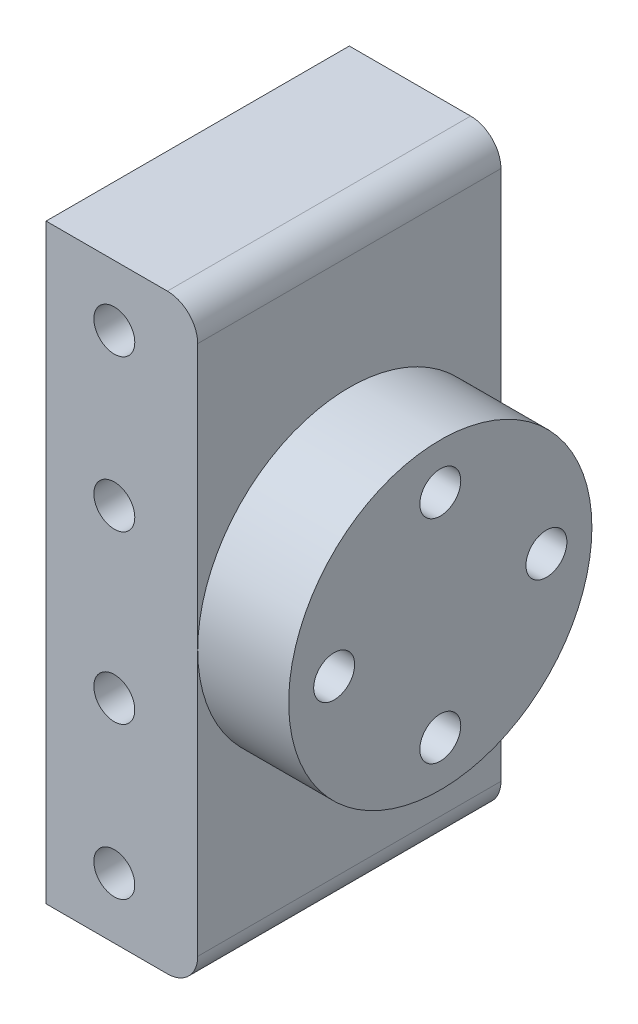
ISO-10303-21;
HEADER;
FILE_DESCRIPTION(('STEP AP214'),'2;1');
FILE_NAME('part.step','',(''),(''),'','','');
FILE_SCHEMA(('AUTOMOTIVE_DESIGN { 1 0 10303 214 1 1 1 1 }'));
ENDSEC;
DATA;
#1=APPLICATION_CONTEXT('core data for automotive mechanical design processes');
#2=APPLICATION_PROTOCOL_DEFINITION('international standard','automotive_design',2000,#1);
#3=PRODUCT_CONTEXT('',#1,'mechanical');
#4=PRODUCT('Part','Part','',(#3));
#5=PRODUCT_RELATED_PRODUCT_CATEGORY('part','',(#4));
#6=PRODUCT_DEFINITION_FORMATION('','',#4);
#7=PRODUCT_DEFINITION_CONTEXT('part definition',#1,'design');
#8=PRODUCT_DEFINITION('design','',#6,#7);
#9=PRODUCT_DEFINITION_SHAPE('','',#8);
#10=(LENGTH_UNIT() NAMED_UNIT(*) SI_UNIT(.MILLI.,.METRE.));
#11=(NAMED_UNIT(*) PLANE_ANGLE_UNIT() SI_UNIT($,.RADIAN.));
#12=(NAMED_UNIT(*) SI_UNIT($,.STERADIAN.) SOLID_ANGLE_UNIT());
#13=UNCERTAINTY_MEASURE_WITH_UNIT(LENGTH_MEASURE(1.E-05),#10,'distance_accuracy_value','');
#14=(GEOMETRIC_REPRESENTATION_CONTEXT(3) GLOBAL_UNCERTAINTY_ASSIGNED_CONTEXT((#13)) GLOBAL_UNIT_ASSIGNED_CONTEXT((#10,
#11,#12)) REPRESENTATION_CONTEXT('',''));
#15=CARTESIAN_POINT('',(0.,0.,0.));
#16=DIRECTION('',(0.,0.,1.));
#17=DIRECTION('',(1.,0.,0.));
#18=AXIS2_PLACEMENT_3D('',#15,#16,#17);
#19=CARTESIAN_POINT('',(5.,-17.5,20.));
#20=DIRECTION('',(-1.,0.,0.));
#21=DIRECTION('',(0.,0.,1.));
#22=AXIS2_PLACEMENT_3D('',#19,#20,#21);
#23=PLANE('',#22);
#24=CARTESIAN_POINT('',(5.,0.,10.));
#25=DIRECTION('',(1.,0.,0.));
#26=DIRECTION('',(0.,0.,-1.));
#27=AXIS2_PLACEMENT_3D('',#24,#25,#26);
#28=CIRCLE('',#27,10.);
#29=CARTESIAN_POINT('',(5.,0.,20.));
#30=VERTEX_POINT('',#29);
#31=CARTESIAN_POINT('',(5.,0.,0.));
#32=VERTEX_POINT('',#31);
#33=EDGE_CURVE('E155',#30,#32,#28,.T.);
#34=ORIENTED_EDGE('',*,*,#33,.F.);
#35=DIRECTION('',(0.,1.,0.));
#36=VECTOR('',#35,1.);
#37=CARTESIAN_POINT('',(5.,-17.5,20.));
#38=LINE('',#37,#36);
#39=CARTESIAN_POINT('',(5.,-17.5,20.));
#40=VERTEX_POINT('',#39);
#41=EDGE_CURVE('E106',#40,#30,#38,.T.);
#42=ORIENTED_EDGE('',*,*,#41,.F.);
#43=DIRECTION('',(0.,0.,-1.));
#44=VECTOR('',#43,1.);
#45=CARTESIAN_POINT('',(5.,-17.5,20.));
#46=LINE('',#45,#44);
#47=CARTESIAN_POINT('',(5.,-17.5,0.));
#48=VERTEX_POINT('',#47);
#49=EDGE_CURVE('E116',#40,#48,#46,.T.);
#50=ORIENTED_EDGE('',*,*,#49,.T.);
#51=DIRECTION('',(0.,1.,0.));
#52=VECTOR('',#51,1.);
#53=CARTESIAN_POINT('',(5.,-17.5,0.));
#54=LINE('',#53,#52);
#55=EDGE_CURVE('E133',#48,#32,#54,.T.);
#56=ORIENTED_EDGE('',*,*,#55,.T.);
#57=EDGE_LOOP('',(#34,#42,#50,#56));
#58=FACE_BOUND('',#57,.T.);
#59=ADVANCED_FACE('F33',(#58),#23,.F.);
#60=CARTESIAN_POINT('',(-5.,-19.5,20.));
#61=DIRECTION('',(1.,0.,0.));
#62=DIRECTION('',(0.,0.,-1.));
#63=AXIS2_PLACEMENT_3D('',#60,#61,#62);
#64=PLANE('',#63);
#65=DIRECTION('',(0.,-1.,0.));
#66=VECTOR('',#65,1.);
#67=CARTESIAN_POINT('',(-5.,-19.5,0.));
#68=LINE('',#67,#66);
#69=CARTESIAN_POINT('',(-5.,19.5,0.));
#70=VERTEX_POINT('',#69);
#71=CARTESIAN_POINT('',(-5.,-19.5,0.));
#72=VERTEX_POINT('',#71);
#73=EDGE_CURVE('E125',#70,#72,#68,.T.);
#74=ORIENTED_EDGE('',*,*,#73,.T.);
#75=DIRECTION('',(0.,0.,-1.));
#76=VECTOR('',#75,1.);
#77=CARTESIAN_POINT('',(-5.,-19.5,20.));
#78=LINE('',#77,#76);
#79=CARTESIAN_POINT('',(-5.,-19.5,20.));
#80=VERTEX_POINT('',#79);
#81=EDGE_CURVE('E11',#80,#72,#78,.T.);
#82=ORIENTED_EDGE('',*,*,#81,.F.);
#83=DIRECTION('',(0.,-1.,0.));
#84=VECTOR('',#83,1.);
#85=CARTESIAN_POINT('',(-5.,-19.5,20.));
#86=LINE('',#85,#84);
#87=CARTESIAN_POINT('',(-5.,19.5,20.));
#88=VERTEX_POINT('',#87);
#89=EDGE_CURVE('E139',#88,#80,#86,.T.);
#90=ORIENTED_EDGE('',*,*,#89,.F.);
#91=DIRECTION('',(0.,0.,-1.));
#92=VECTOR('',#91,1.);
#93=CARTESIAN_POINT('',(-5.,19.5,20.));
#94=LINE('',#93,#92);
#95=EDGE_CURVE('E121',#88,#70,#94,.T.);
#96=ORIENTED_EDGE('',*,*,#95,.T.);
#97=EDGE_LOOP('',(#74,#82,#90,#96));
#98=FACE_BOUND('',#97,.T.);
#99=ADVANCED_FACE('F35',(#98),#64,.F.);
#100=CARTESIAN_POINT('',(-5.,-19.5,20.));
#101=DIRECTION('',(0.,1.,0.));
#102=DIRECTION('',(0.,0.,1.));
#103=AXIS2_PLACEMENT_3D('',#100,#101,#102);
#104=PLANE('',#103);
#105=DIRECTION('',(1.,0.,0.));
#106=VECTOR('',#105,1.);
#107=CARTESIAN_POINT('',(-5.,-19.5,0.));
#108=LINE('',#107,#106);
#109=CARTESIAN_POINT('',(3.,-19.5,0.));
#110=VERTEX_POINT('',#109);
#111=EDGE_CURVE('E128',#72,#110,#108,.T.);
#112=ORIENTED_EDGE('',*,*,#111,.T.);
#113=DIRECTION('',(0.,0.,-1.));
#114=VECTOR('',#113,1.);
#115=CARTESIAN_POINT('',(3.,-19.5,20.));
#116=LINE('',#115,#114);
#117=CARTESIAN_POINT('',(3.,-19.5,20.));
#118=VERTEX_POINT('',#117);
#119=EDGE_CURVE('E41',#118,#110,#116,.T.);
#120=ORIENTED_EDGE('',*,*,#119,.F.);
#121=DIRECTION('',(1.,0.,0.));
#122=VECTOR('',#121,1.);
#123=CARTESIAN_POINT('',(-5.,-19.5,20.));
#124=LINE('',#123,#122);
#125=EDGE_CURVE('E91',#80,#118,#124,.T.);
#126=ORIENTED_EDGE('',*,*,#125,.F.);
#127=ORIENTED_EDGE('',*,*,#81,.T.);
#128=EDGE_LOOP('',(#112,#120,#126,#127));
#129=FACE_BOUND('',#128,.T.);
#130=ADVANCED_FACE('F194',(#129),#104,.F.);
#131=CARTESIAN_POINT('',(3.,-17.5,20.));
#132=DIRECTION('',(0.,0.,-1.));
#133=DIRECTION('',(-1.,0.,0.));
#134=AXIS2_PLACEMENT_3D('',#131,#132,#133);
#135=CYLINDRICAL_SURFACE('',#134,2.);
#136=CARTESIAN_POINT('',(3.,-17.5,0.));
#137=DIRECTION('',(0.,0.,1.));
#138=DIRECTION('',(1.,0.,0.));
#139=AXIS2_PLACEMENT_3D('',#136,#137,#138);
#140=CIRCLE('',#139,2.);
#141=EDGE_CURVE('E131',#110,#48,#140,.T.);
#142=ORIENTED_EDGE('',*,*,#141,.T.);
#143=ORIENTED_EDGE('',*,*,#49,.F.);
#144=CARTESIAN_POINT('',(3.,-17.5,20.));
#145=DIRECTION('',(0.,0.,1.));
#146=DIRECTION('',(1.,0.,0.));
#147=AXIS2_PLACEMENT_3D('',#144,#145,#146);
#148=CIRCLE('',#147,2.);
#149=EDGE_CURVE('E108',#118,#40,#148,.T.);
#150=ORIENTED_EDGE('',*,*,#149,.F.);
#151=ORIENTED_EDGE('',*,*,#119,.T.);
#152=EDGE_LOOP('',(#142,#143,#150,#151));
#153=FACE_BOUND('',#152,.T.);
#154=ADVANCED_FACE('F147',(#153),#135,.T.);
#155=EDGE_CURVE('E48',#32,#30,#28,.T.);
#156=ORIENTED_EDGE('',*,*,#155,.F.);
#157=CARTESIAN_POINT('',(5.,17.5,0.));
#158=VERTEX_POINT('',#157);
#159=EDGE_CURVE('E113',#32,#158,#54,.T.);
#160=ORIENTED_EDGE('',*,*,#159,.T.);
#161=DIRECTION('',(0.,0.,-1.));
#162=VECTOR('',#161,1.);
#163=CARTESIAN_POINT('',(5.,17.5,20.));
#164=LINE('',#163,#162);
#165=CARTESIAN_POINT('',(5.,17.5,20.));
#166=VERTEX_POINT('',#165);
#167=EDGE_CURVE('E111',#166,#158,#164,.T.);
#168=ORIENTED_EDGE('',*,*,#167,.F.);
#169=EDGE_CURVE('E99',#30,#166,#38,.T.);
#170=ORIENTED_EDGE('',*,*,#169,.F.);
#171=EDGE_LOOP('',(#156,#160,#168,#170));
#172=FACE_BOUND('',#171,.T.);
#173=ADVANCED_FACE('F112',(#172),#23,.F.);
#174=CARTESIAN_POINT('',(3.,17.5,20.));
#175=DIRECTION('',(0.,0.,-1.));
#176=DIRECTION('',(-1.,0.,0.));
#177=AXIS2_PLACEMENT_3D('',#174,#175,#176);
#178=CYLINDRICAL_SURFACE('',#177,2.);
#179=CARTESIAN_POINT('',(3.,17.5,0.));
#180=DIRECTION('',(0.,0.,1.));
#181=DIRECTION('',(-1.,0.,0.));
#182=AXIS2_PLACEMENT_3D('',#179,#180,#181);
#183=CIRCLE('',#182,2.);
#184=CARTESIAN_POINT('',(3.,19.5,0.));
#185=VERTEX_POINT('',#184);
#186=EDGE_CURVE('E136',#158,#185,#183,.T.);
#187=ORIENTED_EDGE('',*,*,#186,.T.);
#188=DIRECTION('',(0.,0.,-1.));
#189=VECTOR('',#188,1.);
#190=CARTESIAN_POINT('',(3.,19.5,20.));
#191=LINE('',#190,#189);
#192=CARTESIAN_POINT('',(3.,19.5,20.));
#193=VERTEX_POINT('',#192);
#194=EDGE_CURVE('E117',#193,#185,#191,.T.);
#195=ORIENTED_EDGE('',*,*,#194,.F.);
#196=CARTESIAN_POINT('',(3.,17.5,20.));
#197=DIRECTION('',(0.,0.,1.));
#198=DIRECTION('',(-1.,0.,0.));
#199=AXIS2_PLACEMENT_3D('',#196,#197,#198);
#200=CIRCLE('',#199,2.);
#201=EDGE_CURVE('E103',#166,#193,#200,.T.);
#202=ORIENTED_EDGE('',*,*,#201,.F.);
#203=ORIENTED_EDGE('',*,*,#167,.T.);
#204=EDGE_LOOP('',(#187,#195,#202,#203));
#205=FACE_BOUND('',#204,.T.);
#206=ADVANCED_FACE('F119',(#205),#178,.T.);
#207=CARTESIAN_POINT('',(-5.,19.5,20.));
#208=DIRECTION('',(0.,-1.,0.));
#209=DIRECTION('',(0.,0.,-1.));
#210=AXIS2_PLACEMENT_3D('',#207,#208,#209);
#211=PLANE('',#210);
#212=DIRECTION('',(-1.,0.,0.));
#213=VECTOR('',#212,1.);
#214=CARTESIAN_POINT('',(-5.,19.5,0.));
#215=LINE('',#214,#213);
#216=EDGE_CURVE('E83',#185,#70,#215,.T.);
#217=ORIENTED_EDGE('',*,*,#216,.T.);
#218=ORIENTED_EDGE('',*,*,#95,.F.);
#219=DIRECTION('',(-1.,0.,0.));
#220=VECTOR('',#219,1.);
#221=CARTESIAN_POINT('',(-5.,19.5,20.));
#222=LINE('',#221,#220);
#223=EDGE_CURVE('E57',#193,#88,#222,.T.);
#224=ORIENTED_EDGE('',*,*,#223,.F.);
#225=ORIENTED_EDGE('',*,*,#194,.T.);
#226=EDGE_LOOP('',(#217,#218,#224,#225));
#227=FACE_BOUND('',#226,.T.);
#228=ADVANCED_FACE('F212',(#227),#211,.F.);
#229=CARTESIAN_POINT('',(3.,17.5,20.));
#230=DIRECTION('',(0.,0.,-1.));
#231=DIRECTION('',(-1.,0.,0.));
#232=AXIS2_PLACEMENT_3D('',#229,#230,#231);
#233=PLANE('',#232);
#234=CARTESIAN_POINT('',(-0.5,15.5,20.));
#235=DIRECTION('',(0.,0.,1.));
#236=DIRECTION('',(1.,0.,0.));
#237=AXIS2_PLACEMENT_3D('',#234,#235,#236);
#238=CIRCLE('',#237,1.35);
#239=CARTESIAN_POINT('',(0.85,15.5,20.));
#240=VERTEX_POINT('',#239);
#241=EDGE_CURVE('E169',#240,#240,#238,.T.);
#242=ORIENTED_EDGE('',*,*,#241,.F.);
#243=EDGE_LOOP('',(#242));
#244=FACE_BOUND('',#243,.T.);
#245=CARTESIAN_POINT('',(-0.499999999999896,-5.5,20.));
#246=DIRECTION('',(0.,0.,1.));
#247=DIRECTION('',(-1.,0.,0.));
#248=AXIS2_PLACEMENT_3D('',#245,#246,#247);
#249=CIRCLE('',#248,1.35);
#250=CARTESIAN_POINT('',(-1.8499999999999,-5.5,20.));
#251=VERTEX_POINT('',#250);
#252=EDGE_CURVE('E177',#251,#251,#249,.T.);
#253=ORIENTED_EDGE('',*,*,#252,.F.);
#254=EDGE_LOOP('',(#253));
#255=FACE_BOUND('',#254,.T.);
#256=CARTESIAN_POINT('',(-0.5,-15.5,20.));
#257=DIRECTION('',(0.,0.,1.));
#258=DIRECTION('',(-1.,0.,0.));
#259=AXIS2_PLACEMENT_3D('',#256,#257,#258);
#260=CIRCLE('',#259,1.35);
#261=CARTESIAN_POINT('',(-1.85,-15.5,20.));
#262=VERTEX_POINT('',#261);
#263=EDGE_CURVE('E176',#262,#262,#260,.T.);
#264=ORIENTED_EDGE('',*,*,#263,.F.);
#265=EDGE_LOOP('',(#264));
#266=FACE_BOUND('',#265,.T.);
#267=CARTESIAN_POINT('',(-0.499999999999896,5.5,20.));
#268=DIRECTION('',(0.,0.,1.));
#269=DIRECTION('',(1.,0.,0.));
#270=AXIS2_PLACEMENT_3D('',#267,#268,#269);
#271=CIRCLE('',#270,1.35);
#272=CARTESIAN_POINT('',(0.850000000000104,5.5,20.));
#273=VERTEX_POINT('',#272);
#274=EDGE_CURVE('E182',#273,#273,#271,.T.);
#275=ORIENTED_EDGE('',*,*,#274,.F.);
#276=EDGE_LOOP('',(#275));
#277=FACE_BOUND('',#276,.T.);
#278=ORIENTED_EDGE('',*,*,#89,.T.);
#279=ORIENTED_EDGE('',*,*,#125,.T.);
#280=ORIENTED_EDGE('',*,*,#149,.T.);
#281=ORIENTED_EDGE('',*,*,#41,.T.);
#282=ORIENTED_EDGE('',*,*,#169,.T.);
#283=ORIENTED_EDGE('',*,*,#201,.T.);
#284=ORIENTED_EDGE('',*,*,#223,.T.);
#285=EDGE_LOOP('',(#278,#279,#280,#281,#282,#283,#284));
#286=FACE_BOUND('',#285,.T.);
#287=ADVANCED_FACE('F101',(#244,#255,#266,#277,#286),#233,.F.);
#288=CARTESIAN_POINT('',(3.,17.5,0.));
#289=DIRECTION('',(0.,0.,-1.));
#290=DIRECTION('',(-1.,0.,0.));
#291=AXIS2_PLACEMENT_3D('',#288,#289,#290);
#292=PLANE('',#291);
#293=ORIENTED_EDGE('',*,*,#73,.F.);
#294=ORIENTED_EDGE('',*,*,#216,.F.);
#295=ORIENTED_EDGE('',*,*,#186,.F.);
#296=ORIENTED_EDGE('',*,*,#159,.F.);
#297=ORIENTED_EDGE('',*,*,#55,.F.);
#298=ORIENTED_EDGE('',*,*,#141,.F.);
#299=ORIENTED_EDGE('',*,*,#111,.F.);
#300=EDGE_LOOP('',(#293,#294,#295,#296,#297,#298,#299));
#301=FACE_BOUND('',#300,.T.);
#302=ADVANCED_FACE('F152',(#301),#292,.T.);
#303=CARTESIAN_POINT('',(-0.499999999999896,5.5,8.));
#304=DIRECTION('',(0.,0.,1.));
#305=DIRECTION('',(1.,0.,0.));
#306=AXIS2_PLACEMENT_3D('',#303,#304,#305);
#307=CYLINDRICAL_SURFACE('',#306,1.35);
#308=CARTESIAN_POINT('',(-0.499999999999896,5.5,8.));
#309=DIRECTION('',(0.,0.,1.));
#310=DIRECTION('',(1.,0.,0.));
#311=AXIS2_PLACEMENT_3D('',#308,#309,#310);
#312=CIRCLE('',#311,1.35);
#313=CARTESIAN_POINT('',(0.850000000000104,5.5,8.));
#314=VERTEX_POINT('',#313);
#315=EDGE_CURVE('E172',#314,#314,#312,.T.);
#316=ORIENTED_EDGE('',*,*,#315,.F.);
#317=EDGE_LOOP('',(#316));
#318=FACE_BOUND('',#317,.T.);
#319=ORIENTED_EDGE('',*,*,#274,.T.);
#320=EDGE_LOOP('',(#319));
#321=FACE_BOUND('',#320,.T.);
#322=ADVANCED_FACE('F220',(#318,#321),#307,.F.);
#323=CARTESIAN_POINT('',(-0.499999999999896,5.5,8.));
#324=DIRECTION('',(0.,0.,1.));
#325=DIRECTION('',(1.,0.,0.));
#326=AXIS2_PLACEMENT_3D('',#323,#324,#325);
#327=PLANE('',#326);
#328=ORIENTED_EDGE('',*,*,#315,.T.);
#329=EDGE_LOOP('',(#328));
#330=FACE_BOUND('',#329,.T.);
#331=ADVANCED_FACE('F227',(#330),#327,.T.);
#332=CARTESIAN_POINT('',(-0.5,-15.5,8.));
#333=DIRECTION('',(0.,0.,1.));
#334=DIRECTION('',(1.,0.,0.));
#335=AXIS2_PLACEMENT_3D('',#332,#333,#334);
#336=CYLINDRICAL_SURFACE('',#335,1.35);
#337=CARTESIAN_POINT('',(-0.5,-15.5,8.));
#338=DIRECTION('',(0.,0.,1.));
#339=DIRECTION('',(-1.,0.,0.));
#340=AXIS2_PLACEMENT_3D('',#337,#338,#339);
#341=CIRCLE('',#340,1.35);
#342=CARTESIAN_POINT('',(-1.85,-15.5,8.));
#343=VERTEX_POINT('',#342);
#344=EDGE_CURVE('E185',#343,#343,#341,.T.);
#345=ORIENTED_EDGE('',*,*,#344,.F.);
#346=EDGE_LOOP('',(#345));
#347=FACE_BOUND('',#346,.T.);
#348=ORIENTED_EDGE('',*,*,#263,.T.);
#349=EDGE_LOOP('',(#348));
#350=FACE_BOUND('',#349,.T.);
#351=ADVANCED_FACE('F223',(#347,#350),#336,.F.);
#352=CARTESIAN_POINT('',(-0.5,-15.5,8.));
#353=DIRECTION('',(0.,0.,-1.));
#354=DIRECTION('',(-1.,0.,0.));
#355=AXIS2_PLACEMENT_3D('',#352,#353,#354);
#356=PLANE('',#355);
#357=ORIENTED_EDGE('',*,*,#344,.T.);
#358=EDGE_LOOP('',(#357));
#359=FACE_BOUND('',#358,.T.);
#360=ADVANCED_FACE('F226',(#359),#356,.F.);
#361=CARTESIAN_POINT('',(-0.499999999999896,-5.5,8.));
#362=DIRECTION('',(0.,0.,1.));
#363=DIRECTION('',(1.,0.,0.));
#364=AXIS2_PLACEMENT_3D('',#361,#362,#363);
#365=CYLINDRICAL_SURFACE('',#364,1.35);
#366=CARTESIAN_POINT('',(-0.499999999999896,-5.5,8.));
#367=DIRECTION('',(0.,0.,1.));
#368=DIRECTION('',(-1.,0.,0.));
#369=AXIS2_PLACEMENT_3D('',#366,#367,#368);
#370=CIRCLE('',#369,1.35);
#371=CARTESIAN_POINT('',(-1.8499999999999,-5.5,8.));
#372=VERTEX_POINT('',#371);
#373=EDGE_CURVE('E173',#372,#372,#370,.T.);
#374=ORIENTED_EDGE('',*,*,#373,.F.);
#375=EDGE_LOOP('',(#374));
#376=FACE_BOUND('',#375,.T.);
#377=ORIENTED_EDGE('',*,*,#252,.T.);
#378=EDGE_LOOP('',(#377));
#379=FACE_BOUND('',#378,.T.);
#380=ADVANCED_FACE('F231',(#376,#379),#365,.F.);
#381=CARTESIAN_POINT('',(-0.499999999999896,-5.5,8.));
#382=DIRECTION('',(0.,0.,-1.));
#383=DIRECTION('',(-1.,0.,0.));
#384=AXIS2_PLACEMENT_3D('',#381,#382,#383);
#385=PLANE('',#384);
#386=ORIENTED_EDGE('',*,*,#373,.T.);
#387=EDGE_LOOP('',(#386));
#388=FACE_BOUND('',#387,.T.);
#389=ADVANCED_FACE('F241',(#388),#385,.F.);
#390=CARTESIAN_POINT('',(-0.5,15.5,8.));
#391=DIRECTION('',(0.,0.,1.));
#392=DIRECTION('',(1.,0.,0.));
#393=AXIS2_PLACEMENT_3D('',#390,#391,#392);
#394=CYLINDRICAL_SURFACE('',#393,1.35);
#395=CARTESIAN_POINT('',(-0.5,15.5,8.));
#396=DIRECTION('',(0.,0.,1.));
#397=DIRECTION('',(1.,0.,0.));
#398=AXIS2_PLACEMENT_3D('',#395,#396,#397);
#399=CIRCLE('',#398,1.35);
#400=CARTESIAN_POINT('',(0.85,15.5,8.));
#401=VERTEX_POINT('',#400);
#402=EDGE_CURVE('E129',#401,#401,#399,.T.);
#403=ORIENTED_EDGE('',*,*,#402,.F.);
#404=EDGE_LOOP('',(#403));
#405=FACE_BOUND('',#404,.T.);
#406=ORIENTED_EDGE('',*,*,#241,.T.);
#407=EDGE_LOOP('',(#406));
#408=FACE_BOUND('',#407,.T.);
#409=ADVANCED_FACE('F245',(#405,#408),#394,.F.);
#410=CARTESIAN_POINT('',(-0.5,15.5,8.));
#411=DIRECTION('',(0.,0.,1.));
#412=DIRECTION('',(1.,0.,0.));
#413=AXIS2_PLACEMENT_3D('',#410,#411,#412);
#414=PLANE('',#413);
#415=ORIENTED_EDGE('',*,*,#402,.T.);
#416=EDGE_LOOP('',(#415));
#417=FACE_BOUND('',#416,.T.);
#418=ADVANCED_FACE('F249',(#417),#414,.T.);
#419=CARTESIAN_POINT('',(11.,0.,10.));
#420=DIRECTION('',(-1.,0.,0.));
#421=DIRECTION('',(0.,0.,1.));
#422=AXIS2_PLACEMENT_3D('',#419,#420,#421);
#423=CYLINDRICAL_SURFACE('',#422,10.);
#424=CARTESIAN_POINT('',(11.,0.,10.));
#425=DIRECTION('',(1.,0.,0.));
#426=DIRECTION('',(0.,0.,-1.));
#427=AXIS2_PLACEMENT_3D('',#424,#425,#426);
#428=CIRCLE('',#427,10.);
#429=CARTESIAN_POINT('',(11.,0.,0.));
#430=VERTEX_POINT('',#429);
#431=EDGE_CURVE('E160',#430,#430,#428,.T.);
#432=ORIENTED_EDGE('',*,*,#431,.F.);
#433=EDGE_LOOP('',(#432));
#434=FACE_BOUND('',#433,.T.);
#435=ORIENTED_EDGE('',*,*,#155,.T.);
#436=ORIENTED_EDGE('',*,*,#33,.T.);
#437=EDGE_LOOP('',(#435,#436));
#438=FACE_BOUND('',#437,.T.);
#439=ADVANCED_FACE('F157',(#434,#438),#423,.T.);
#440=CARTESIAN_POINT('',(11.,0.,10.));
#441=DIRECTION('',(1.,0.,0.));
#442=DIRECTION('',(0.,0.,-1.));
#443=AXIS2_PLACEMENT_3D('',#440,#441,#442);
#444=PLANE('',#443);
#445=CARTESIAN_POINT('',(11.,7.,10.));
#446=DIRECTION('',(1.,0.,0.));
#447=DIRECTION('',(0.,0.,-1.));
#448=AXIS2_PLACEMENT_3D('',#445,#446,#447);
#449=CIRCLE('',#448,1.35);
#450=CARTESIAN_POINT('',(11.,7.,8.65));
#451=VERTEX_POINT('',#450);
#452=EDGE_CURVE('E162',#451,#451,#449,.T.);
#453=ORIENTED_EDGE('',*,*,#452,.F.);
#454=EDGE_LOOP('',(#453));
#455=FACE_BOUND('',#454,.T.);
#456=CARTESIAN_POINT('',(11.,0.,17.));
#457=DIRECTION('',(1.,0.,0.));
#458=DIRECTION('',(0.,0.,-1.));
#459=AXIS2_PLACEMENT_3D('',#456,#457,#458);
#460=CIRCLE('',#459,1.35);
#461=CARTESIAN_POINT('',(11.,0.,15.65));
#462=VERTEX_POINT('',#461);
#463=EDGE_CURVE('E301',#462,#462,#460,.T.);
#464=ORIENTED_EDGE('',*,*,#463,.F.);
#465=EDGE_LOOP('',(#464));
#466=FACE_BOUND('',#465,.T.);
#467=CARTESIAN_POINT('',(11.,0.,3.));
#468=DIRECTION('',(1.,0.,0.));
#469=DIRECTION('',(0.,0.,-1.));
#470=AXIS2_PLACEMENT_3D('',#467,#468,#469);
#471=CIRCLE('',#470,1.35);
#472=CARTESIAN_POINT('',(11.,0.,1.65));
#473=VERTEX_POINT('',#472);
#474=EDGE_CURVE('E309',#473,#473,#471,.T.);
#475=ORIENTED_EDGE('',*,*,#474,.F.);
#476=EDGE_LOOP('',(#475));
#477=FACE_BOUND('',#476,.T.);
#478=CARTESIAN_POINT('',(11.,-7.,10.));
#479=DIRECTION('',(1.,0.,0.));
#480=DIRECTION('',(0.,0.,-1.));
#481=AXIS2_PLACEMENT_3D('',#478,#479,#480);
#482=CIRCLE('',#481,1.35);
#483=CARTESIAN_POINT('',(11.,-7.,8.65));
#484=VERTEX_POINT('',#483);
#485=EDGE_CURVE('E314',#484,#484,#482,.T.);
#486=ORIENTED_EDGE('',*,*,#485,.F.);
#487=EDGE_LOOP('',(#486));
#488=FACE_BOUND('',#487,.T.);
#489=ORIENTED_EDGE('',*,*,#431,.T.);
#490=EDGE_LOOP('',(#489));
#491=FACE_BOUND('',#490,.T.);
#492=ADVANCED_FACE('F256',(#455,#466,#477,#488,#491),#444,.T.);
#493=CARTESIAN_POINT('',(0.999999999999999,-7.,10.));
#494=DIRECTION('',(1.,0.,0.));
#495=DIRECTION('',(0.,0.,-1.));
#496=AXIS2_PLACEMENT_3D('',#493,#494,#495);
#497=CYLINDRICAL_SURFACE('',#496,1.35);
#498=CARTESIAN_POINT('',(0.999999999999999,-7.,10.));
#499=DIRECTION('',(1.,0.,0.));
#500=DIRECTION('',(0.,0.,-1.));
#501=AXIS2_PLACEMENT_3D('',#498,#499,#500);
#502=CIRCLE('',#501,1.35);
#503=CARTESIAN_POINT('',(0.999999999999999,-7.,8.65));
#504=VERTEX_POINT('',#503);
#505=EDGE_CURVE('E312',#504,#504,#502,.T.);
#506=ORIENTED_EDGE('',*,*,#505,.F.);
#507=EDGE_LOOP('',(#506));
#508=FACE_BOUND('',#507,.T.);
#509=ORIENTED_EDGE('',*,*,#485,.T.);
#510=EDGE_LOOP('',(#509));
#511=FACE_BOUND('',#510,.T.);
#512=ADVANCED_FACE('F260',(#508,#511),#497,.F.);
#513=CARTESIAN_POINT('',(0.999999999999999,-7.,10.));
#514=DIRECTION('',(1.,0.,0.));
#515=DIRECTION('',(0.,0.,-1.));
#516=AXIS2_PLACEMENT_3D('',#513,#514,#515);
#517=PLANE('',#516);
#518=ORIENTED_EDGE('',*,*,#505,.T.);
#519=EDGE_LOOP('',(#518));
#520=FACE_BOUND('',#519,.T.);
#521=ADVANCED_FACE('F264',(#520),#517,.T.);
#522=CARTESIAN_POINT('',(0.999999999999999,0.,3.));
#523=DIRECTION('',(1.,0.,0.));
#524=DIRECTION('',(0.,0.,-1.));
#525=AXIS2_PLACEMENT_3D('',#522,#523,#524);
#526=CYLINDRICAL_SURFACE('',#525,1.35);
#527=CARTESIAN_POINT('',(0.999999999999999,0.,3.));
#528=DIRECTION('',(1.,0.,0.));
#529=DIRECTION('',(0.,0.,-1.));
#530=AXIS2_PLACEMENT_3D('',#527,#528,#529);
#531=CIRCLE('',#530,1.35);
#532=CARTESIAN_POINT('',(0.999999999999999,0.,1.65));
#533=VERTEX_POINT('',#532);
#534=EDGE_CURVE('E306',#533,#533,#531,.T.);
#535=ORIENTED_EDGE('',*,*,#534,.F.);
#536=EDGE_LOOP('',(#535));
#537=FACE_BOUND('',#536,.T.);
#538=ORIENTED_EDGE('',*,*,#474,.T.);
#539=EDGE_LOOP('',(#538));
#540=FACE_BOUND('',#539,.T.);
#541=ADVANCED_FACE('F268',(#537,#540),#526,.F.);
#542=CARTESIAN_POINT('',(0.999999999999999,0.,3.));
#543=DIRECTION('',(1.,0.,0.));
#544=DIRECTION('',(0.,0.,-1.));
#545=AXIS2_PLACEMENT_3D('',#542,#543,#544);
#546=PLANE('',#545);
#547=ORIENTED_EDGE('',*,*,#534,.T.);
#548=EDGE_LOOP('',(#547));
#549=FACE_BOUND('',#548,.T.);
#550=ADVANCED_FACE('F272',(#549),#546,.T.);
#551=CARTESIAN_POINT('',(0.999999999999999,0.,17.));
#552=DIRECTION('',(1.,0.,0.));
#553=DIRECTION('',(0.,0.,-1.));
#554=AXIS2_PLACEMENT_3D('',#551,#552,#553);
#555=CYLINDRICAL_SURFACE('',#554,1.35);
#556=CARTESIAN_POINT('',(0.999999999999999,0.,17.));
#557=DIRECTION('',(1.,0.,0.));
#558=DIRECTION('',(0.,0.,-1.));
#559=AXIS2_PLACEMENT_3D('',#556,#557,#558);
#560=CIRCLE('',#559,1.35);
#561=CARTESIAN_POINT('',(0.999999999999999,0.,15.65));
#562=VERTEX_POINT('',#561);
#563=EDGE_CURVE('E298',#562,#562,#560,.T.);
#564=ORIENTED_EDGE('',*,*,#563,.F.);
#565=EDGE_LOOP('',(#564));
#566=FACE_BOUND('',#565,.T.);
#567=ORIENTED_EDGE('',*,*,#463,.T.);
#568=EDGE_LOOP('',(#567));
#569=FACE_BOUND('',#568,.T.);
#570=ADVANCED_FACE('F276',(#566,#569),#555,.F.);
#571=CARTESIAN_POINT('',(0.999999999999999,0.,17.));
#572=DIRECTION('',(1.,0.,0.));
#573=DIRECTION('',(0.,0.,-1.));
#574=AXIS2_PLACEMENT_3D('',#571,#572,#573);
#575=PLANE('',#574);
#576=ORIENTED_EDGE('',*,*,#563,.T.);
#577=EDGE_LOOP('',(#576));
#578=FACE_BOUND('',#577,.T.);
#579=ADVANCED_FACE('F280',(#578),#575,.T.);
#580=CARTESIAN_POINT('',(0.999999999999999,7.,10.));
#581=DIRECTION('',(1.,0.,0.));
#582=DIRECTION('',(0.,0.,-1.));
#583=AXIS2_PLACEMENT_3D('',#580,#581,#582);
#584=CYLINDRICAL_SURFACE('',#583,1.35);
#585=CARTESIAN_POINT('',(0.999999999999999,7.,10.));
#586=DIRECTION('',(1.,0.,0.));
#587=DIRECTION('',(0.,0.,-1.));
#588=AXIS2_PLACEMENT_3D('',#585,#586,#587);
#589=CIRCLE('',#588,1.35);
#590=CARTESIAN_POINT('',(0.999999999999999,7.,8.65));
#591=VERTEX_POINT('',#590);
#592=EDGE_CURVE('E158',#591,#591,#589,.T.);
#593=ORIENTED_EDGE('',*,*,#592,.F.);
#594=EDGE_LOOP('',(#593));
#595=FACE_BOUND('',#594,.T.);
#596=ORIENTED_EDGE('',*,*,#452,.T.);
#597=EDGE_LOOP('',(#596));
#598=FACE_BOUND('',#597,.T.);
#599=ADVANCED_FACE('F284',(#595,#598),#584,.F.);
#600=CARTESIAN_POINT('',(0.999999999999999,7.,10.));
#601=DIRECTION('',(1.,0.,0.));
#602=DIRECTION('',(0.,0.,-1.));
#603=AXIS2_PLACEMENT_3D('',#600,#601,#602);
#604=PLANE('',#603);
#605=ORIENTED_EDGE('',*,*,#592,.T.);
#606=EDGE_LOOP('',(#605));
#607=FACE_BOUND('',#606,.T.);
#608=ADVANCED_FACE('F288',(#607),#604,.T.);
#609=CLOSED_SHELL('',(#59,#99,#130,#154,#173,#206,#228,#287,#302,#322,#331,#351,#360,#380,#389,
#409,#418,#439,#492,#512,#521,#541,#550,#570,#579,#599,#608));
#610=MANIFOLD_SOLID_BREP('B2',#609);
#611=ADVANCED_BREP_SHAPE_REPRESENTATION('',(#18,#610),#14);
#612=SHAPE_DEFINITION_REPRESENTATION(#9,#611);
ENDSEC;
END-ISO-10303-21;
